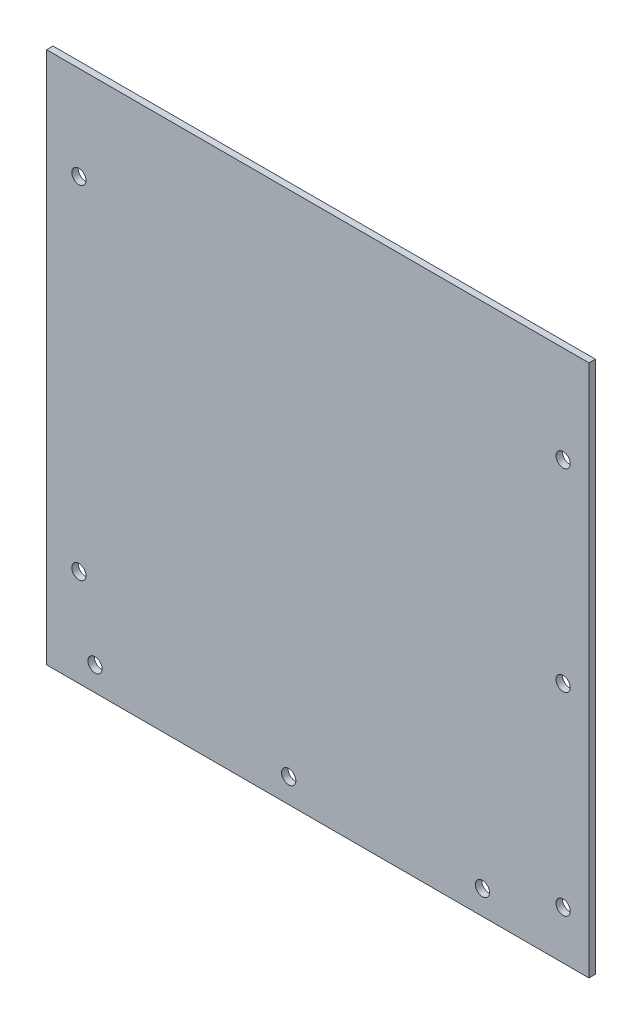
ISO-10303-21;
HEADER;
FILE_DESCRIPTION(('STEP AP214'),'2;1');
FILE_NAME('part.step','',(''),(''),'','','');
FILE_SCHEMA(('AUTOMOTIVE_DESIGN { 1 0 10303 214 1 1 1 1 }'));
ENDSEC;
DATA;
#1=APPLICATION_CONTEXT('core data for automotive mechanical design processes');
#2=APPLICATION_PROTOCOL_DEFINITION('international standard','automotive_design',2000,#1);
#3=PRODUCT_CONTEXT('',#1,'mechanical');
#4=PRODUCT('Part','Part','',(#3));
#5=PRODUCT_RELATED_PRODUCT_CATEGORY('part','',(#4));
#6=PRODUCT_DEFINITION_FORMATION('','',#4);
#7=PRODUCT_DEFINITION_CONTEXT('part definition',#1,'design');
#8=PRODUCT_DEFINITION('design','',#6,#7);
#9=PRODUCT_DEFINITION_SHAPE('','',#8);
#10=(LENGTH_UNIT() NAMED_UNIT(*) SI_UNIT(.MILLI.,.METRE.));
#11=(NAMED_UNIT(*) PLANE_ANGLE_UNIT() SI_UNIT($,.RADIAN.));
#12=(NAMED_UNIT(*) SI_UNIT($,.STERADIAN.) SOLID_ANGLE_UNIT());
#13=UNCERTAINTY_MEASURE_WITH_UNIT(LENGTH_MEASURE(1.E-05),#10,'distance_accuracy_value','');
#14=(GEOMETRIC_REPRESENTATION_CONTEXT(3) GLOBAL_UNCERTAINTY_ASSIGNED_CONTEXT((#13)) GLOBAL_UNIT_ASSIGNED_CONTEXT((#10,
#11,#12)) REPRESENTATION_CONTEXT('',''));
#15=CARTESIAN_POINT('',(0.,0.,0.));
#16=DIRECTION('',(0.,0.,1.));
#17=DIRECTION('',(1.,0.,0.));
#18=AXIS2_PLACEMENT_3D('',#15,#16,#17);
#19=CARTESIAN_POINT('',(84.,83.5,2.));
#20=DIRECTION('',(-1.,0.,0.));
#21=DIRECTION('',(0.,-1.,0.));
#22=AXIS2_PLACEMENT_3D('',#19,#20,#21);
#23=PLANE('',#22);
#24=DIRECTION('',(0.,1.,0.));
#25=VECTOR('',#24,1.);
#26=CARTESIAN_POINT('',(84.,83.5,0.));
#27=LINE('',#26,#25);
#28=CARTESIAN_POINT('',(84.,-83.5,0.));
#29=VERTEX_POINT('',#28);
#30=CARTESIAN_POINT('',(84.,81.5,0.));
#31=VERTEX_POINT('',#30);
#32=EDGE_CURVE('E88',#29,#31,#27,.T.);
#33=ORIENTED_EDGE('',*,*,#32,.T.);
#34=DIRECTION('',(0.,0.,-1.));
#35=VECTOR('',#34,1.);
#36=CARTESIAN_POINT('',(84.,81.5,2.));
#37=LINE('',#36,#35);
#38=CARTESIAN_POINT('',(84.,81.5,2.));
#39=VERTEX_POINT('',#38);
#40=EDGE_CURVE('E53',#39,#31,#37,.T.);
#41=ORIENTED_EDGE('',*,*,#40,.F.);
#42=DIRECTION('',(0.,1.,0.));
#43=VECTOR('',#42,1.);
#44=CARTESIAN_POINT('',(84.,83.5,2.));
#45=LINE('',#44,#43);
#46=CARTESIAN_POINT('',(84.,-83.5,2.));
#47=VERTEX_POINT('',#46);
#48=EDGE_CURVE('E83',#47,#39,#45,.T.);
#49=ORIENTED_EDGE('',*,*,#48,.F.);
#50=DIRECTION('',(0.,0.,-1.));
#51=VECTOR('',#50,1.);
#52=CARTESIAN_POINT('',(84.,-83.5,2.));
#53=LINE('',#52,#51);
#54=EDGE_CURVE('E46',#47,#29,#53,.T.);
#55=ORIENTED_EDGE('',*,*,#54,.T.);
#56=EDGE_LOOP('',(#33,#41,#49,#55));
#57=FACE_BOUND('',#56,.T.);
#58=ADVANCED_FACE('F38',(#57),#23,.F.);
#59=CARTESIAN_POINT('',(-84.,83.5,2.));
#60=DIRECTION('',(1.,0.,0.));
#61=DIRECTION('',(0.,1.,0.));
#62=AXIS2_PLACEMENT_3D('',#59,#60,#61);
#63=PLANE('',#62);
#64=DIRECTION('',(0.,-1.,0.));
#65=VECTOR('',#64,1.);
#66=CARTESIAN_POINT('',(-84.,83.5,2.));
#67=LINE('',#66,#65);
#68=CARTESIAN_POINT('',(-84.,81.5,2.));
#69=VERTEX_POINT('',#68);
#70=CARTESIAN_POINT('',(-84.,-83.5,2.));
#71=VERTEX_POINT('',#70);
#72=EDGE_CURVE('E104',#69,#71,#67,.T.);
#73=ORIENTED_EDGE('',*,*,#72,.F.);
#74=DIRECTION('',(0.,0.,1.));
#75=VECTOR('',#74,1.);
#76=CARTESIAN_POINT('',(-84.,81.5,2.));
#77=LINE('',#76,#75);
#78=CARTESIAN_POINT('',(-84.,81.5,0.));
#79=VERTEX_POINT('',#78);
#80=EDGE_CURVE('E135',#79,#69,#77,.T.);
#81=ORIENTED_EDGE('',*,*,#80,.F.);
#82=DIRECTION('',(0.,-1.,0.));
#83=VECTOR('',#82,1.);
#84=CARTESIAN_POINT('',(-84.,83.5,0.));
#85=LINE('',#84,#83);
#86=CARTESIAN_POINT('',(-84.,-83.5,0.));
#87=VERTEX_POINT('',#86);
#88=EDGE_CURVE('E84',#79,#87,#85,.T.);
#89=ORIENTED_EDGE('',*,*,#88,.T.);
#90=DIRECTION('',(0.,0.,-1.));
#91=VECTOR('',#90,1.);
#92=CARTESIAN_POINT('',(-84.,-83.5,2.));
#93=LINE('',#92,#91);
#94=EDGE_CURVE('E11',#71,#87,#93,.T.);
#95=ORIENTED_EDGE('',*,*,#94,.F.);
#96=EDGE_LOOP('',(#73,#81,#89,#95));
#97=FACE_BOUND('',#96,.T.);
#98=ADVANCED_FACE('F213',(#97),#63,.F.);
#99=CARTESIAN_POINT('',(-84.,-83.5,2.));
#100=DIRECTION('',(0.,1.,0.));
#101=DIRECTION('',(0.,0.,1.));
#102=AXIS2_PLACEMENT_3D('',#99,#100,#101);
#103=PLANE('',#102);
#104=DIRECTION('',(1.,0.,0.));
#105=VECTOR('',#104,1.);
#106=CARTESIAN_POINT('',(-84.,-83.5,0.));
#107=LINE('',#106,#105);
#108=EDGE_CURVE('E74',#87,#29,#107,.T.);
#109=ORIENTED_EDGE('',*,*,#108,.T.);
#110=ORIENTED_EDGE('',*,*,#54,.F.);
#111=DIRECTION('',(1.,0.,0.));
#112=VECTOR('',#111,1.);
#113=CARTESIAN_POINT('',(-84.,-83.5,2.));
#114=LINE('',#113,#112);
#115=EDGE_CURVE('E62',#71,#47,#114,.T.);
#116=ORIENTED_EDGE('',*,*,#115,.F.);
#117=ORIENTED_EDGE('',*,*,#94,.T.);
#118=EDGE_LOOP('',(#109,#110,#116,#117));
#119=FACE_BOUND('',#118,.T.);
#120=ADVANCED_FACE('F76',(#119),#103,.F.);
#121=CARTESIAN_POINT('',(0.,0.,2.));
#122=DIRECTION('',(0.,0.,1.));
#123=DIRECTION('',(1.,0.,0.));
#124=AXIS2_PLACEMENT_3D('',#121,#122,#123);
#125=PLANE('',#124);
#126=CARTESIAN_POINT('',(-74.,-53.5,2.));
#127=DIRECTION('',(0.,0.,1.));
#128=DIRECTION('',(1.,0.,0.));
#129=AXIS2_PLACEMENT_3D('',#126,#127,#128);
#130=CIRCLE('',#129,2.2);
#131=CARTESIAN_POINT('',(-71.8,-53.5,2.));
#132=VERTEX_POINT('',#131);
#133=EDGE_CURVE('E171',#132,#132,#130,.T.);
#134=ORIENTED_EDGE('',*,*,#133,.F.);
#135=EDGE_LOOP('',(#134));
#136=FACE_BOUND('',#135,.T.);
#137=CARTESIAN_POINT('',(-74.,52.5,2.));
#138=DIRECTION('',(0.,0.,1.));
#139=DIRECTION('',(1.,0.,0.));
#140=AXIS2_PLACEMENT_3D('',#137,#138,#139);
#141=CIRCLE('',#140,2.2);
#142=CARTESIAN_POINT('',(-71.8,52.5,2.));
#143=VERTEX_POINT('',#142);
#144=EDGE_CURVE('E153',#143,#143,#141,.T.);
#145=ORIENTED_EDGE('',*,*,#144,.F.);
#146=EDGE_LOOP('',(#145));
#147=FACE_BOUND('',#146,.T.);
#148=CARTESIAN_POINT('',(51.,-76.,2.));
#149=DIRECTION('',(0.,0.,1.));
#150=DIRECTION('',(1.,0.,0.));
#151=AXIS2_PLACEMENT_3D('',#148,#149,#150);
#152=CIRCLE('',#151,2.19999999999999);
#153=CARTESIAN_POINT('',(53.2,-76.,2.));
#154=VERTEX_POINT('',#153);
#155=EDGE_CURVE('E152',#154,#154,#152,.T.);
#156=ORIENTED_EDGE('',*,*,#155,.F.);
#157=EDGE_LOOP('',(#156));
#158=FACE_BOUND('',#157,.T.);
#159=CARTESIAN_POINT('',(-69.,-76.,2.));
#160=DIRECTION('',(0.,0.,1.));
#161=DIRECTION('',(1.,0.,0.));
#162=AXIS2_PLACEMENT_3D('',#159,#160,#161);
#163=CIRCLE('',#162,2.2);
#164=CARTESIAN_POINT('',(-66.8,-76.,2.));
#165=VERTEX_POINT('',#164);
#166=EDGE_CURVE('E144',#165,#165,#163,.T.);
#167=ORIENTED_EDGE('',*,*,#166,.F.);
#168=EDGE_LOOP('',(#167));
#169=FACE_BOUND('',#168,.T.);
#170=CARTESIAN_POINT('',(-9.00000000000001,-76.,2.));
#171=DIRECTION('',(0.,0.,1.));
#172=DIRECTION('',(1.,0.,0.));
#173=AXIS2_PLACEMENT_3D('',#170,#171,#172);
#174=CIRCLE('',#173,2.2);
#175=CARTESIAN_POINT('',(-6.80000000000001,-76.,2.));
#176=VERTEX_POINT('',#175);
#177=EDGE_CURVE('E140',#176,#176,#174,.T.);
#178=ORIENTED_EDGE('',*,*,#177,.F.);
#179=EDGE_LOOP('',(#178));
#180=FACE_BOUND('',#179,.T.);
#181=DIRECTION('',(1.,0.,0.));
#182=VECTOR('',#181,1.);
#183=CARTESIAN_POINT('',(-84.,81.5,2.));
#184=LINE('',#183,#182);
#185=EDGE_CURVE('E132',#69,#39,#184,.T.);
#186=ORIENTED_EDGE('',*,*,#185,.F.);
#187=ORIENTED_EDGE('',*,*,#72,.T.);
#188=ORIENTED_EDGE('',*,*,#115,.T.);
#189=ORIENTED_EDGE('',*,*,#48,.T.);
#190=EDGE_LOOP('',(#186,#187,#188,#189));
#191=FACE_BOUND('',#190,.T.);
#192=CARTESIAN_POINT('',(76.,51.5,2.));
#193=DIRECTION('',(0.,0.,1.));
#194=DIRECTION('',(1.,0.,0.));
#195=AXIS2_PLACEMENT_3D('',#192,#193,#194);
#196=CIRCLE('',#195,2.2);
#197=CARTESIAN_POINT('',(78.2,51.5,2.));
#198=VERTEX_POINT('',#197);
#199=EDGE_CURVE('E99',#198,#198,#196,.T.);
#200=ORIENTED_EDGE('',*,*,#199,.F.);
#201=EDGE_LOOP('',(#200));
#202=FACE_BOUND('',#201,.T.);
#203=CARTESIAN_POINT('',(76.,-8.50000000000001,2.));
#204=DIRECTION('',(0.,0.,1.));
#205=DIRECTION('',(1.,0.,0.));
#206=AXIS2_PLACEMENT_3D('',#203,#204,#205);
#207=CIRCLE('',#206,2.20000000000001);
#208=CARTESIAN_POINT('',(78.2,-8.50000000000001,2.));
#209=VERTEX_POINT('',#208);
#210=EDGE_CURVE('E117',#209,#209,#207,.T.);
#211=ORIENTED_EDGE('',*,*,#210,.F.);
#212=EDGE_LOOP('',(#211));
#213=FACE_BOUND('',#212,.T.);
#214=CARTESIAN_POINT('',(76.,-68.5,2.));
#215=DIRECTION('',(0.,0.,1.));
#216=DIRECTION('',(1.,0.,0.));
#217=AXIS2_PLACEMENT_3D('',#214,#215,#216);
#218=CIRCLE('',#217,2.2);
#219=CARTESIAN_POINT('',(78.2,-68.5,2.));
#220=VERTEX_POINT('',#219);
#221=EDGE_CURVE('E109',#220,#220,#218,.T.);
#222=ORIENTED_EDGE('',*,*,#221,.F.);
#223=EDGE_LOOP('',(#222));
#224=FACE_BOUND('',#223,.T.);
#225=ADVANCED_FACE('F185',(#136,#147,#158,#169,#180,#191,#202,#213,#224),#125,.T.);
#226=CARTESIAN_POINT('',(0.,0.,0.));
#227=DIRECTION('',(0.,0.,1.));
#228=DIRECTION('',(1.,0.,0.));
#229=AXIS2_PLACEMENT_3D('',#226,#227,#228);
#230=PLANE('',#229);
#231=CARTESIAN_POINT('',(-74.,-53.5,0.));
#232=DIRECTION('',(0.,0.,-1.));
#233=DIRECTION('',(-1.,0.,0.));
#234=AXIS2_PLACEMENT_3D('',#231,#232,#233);
#235=CIRCLE('',#234,2.2);
#236=CARTESIAN_POINT('',(-76.2,-53.5,0.));
#237=VERTEX_POINT('',#236);
#238=EDGE_CURVE('E175',#237,#237,#235,.T.);
#239=ORIENTED_EDGE('',*,*,#238,.F.);
#240=EDGE_LOOP('',(#239));
#241=FACE_BOUND('',#240,.T.);
#242=CARTESIAN_POINT('',(-74.,52.5,0.));
#243=DIRECTION('',(0.,0.,-1.));
#244=DIRECTION('',(-1.,0.,0.));
#245=AXIS2_PLACEMENT_3D('',#242,#243,#244);
#246=CIRCLE('',#245,2.2);
#247=CARTESIAN_POINT('',(-76.2,52.5,0.));
#248=VERTEX_POINT('',#247);
#249=EDGE_CURVE('E167',#248,#248,#246,.T.);
#250=ORIENTED_EDGE('',*,*,#249,.F.);
#251=EDGE_LOOP('',(#250));
#252=FACE_BOUND('',#251,.T.);
#253=CARTESIAN_POINT('',(51.,-76.,0.));
#254=DIRECTION('',(0.,0.,1.));
#255=DIRECTION('',(1.,0.,0.));
#256=AXIS2_PLACEMENT_3D('',#253,#254,#255);
#257=CIRCLE('',#256,2.19999999999999);
#258=CARTESIAN_POINT('',(53.2,-76.,0.));
#259=VERTEX_POINT('',#258);
#260=EDGE_CURVE('E148',#259,#259,#257,.T.);
#261=ORIENTED_EDGE('',*,*,#260,.T.);
#262=EDGE_LOOP('',(#261));
#263=FACE_BOUND('',#262,.T.);
#264=CARTESIAN_POINT('',(-69.,-76.,0.));
#265=DIRECTION('',(0.,0.,1.));
#266=DIRECTION('',(1.,0.,0.));
#267=AXIS2_PLACEMENT_3D('',#264,#265,#266);
#268=CIRCLE('',#267,2.2);
#269=CARTESIAN_POINT('',(-66.8,-76.,0.));
#270=VERTEX_POINT('',#269);
#271=EDGE_CURVE('E157',#270,#270,#268,.T.);
#272=ORIENTED_EDGE('',*,*,#271,.T.);
#273=EDGE_LOOP('',(#272));
#274=FACE_BOUND('',#273,.T.);
#275=CARTESIAN_POINT('',(-9.00000000000001,-76.,0.));
#276=DIRECTION('',(0.,0.,1.));
#277=DIRECTION('',(1.,0.,0.));
#278=AXIS2_PLACEMENT_3D('',#275,#276,#277);
#279=CIRCLE('',#278,2.2);
#280=CARTESIAN_POINT('',(-6.80000000000001,-76.,0.));
#281=VERTEX_POINT('',#280);
#282=EDGE_CURVE('E139',#281,#281,#279,.T.);
#283=ORIENTED_EDGE('',*,*,#282,.T.);
#284=EDGE_LOOP('',(#283));
#285=FACE_BOUND('',#284,.T.);
#286=CARTESIAN_POINT('',(76.,51.5,0.));
#287=DIRECTION('',(0.,0.,1.));
#288=DIRECTION('',(1.,0.,0.));
#289=AXIS2_PLACEMENT_3D('',#286,#287,#288);
#290=CIRCLE('',#289,2.2);
#291=CARTESIAN_POINT('',(78.2,51.5,0.));
#292=VERTEX_POINT('',#291);
#293=EDGE_CURVE('E93',#292,#292,#290,.T.);
#294=ORIENTED_EDGE('',*,*,#293,.T.);
#295=EDGE_LOOP('',(#294));
#296=FACE_BOUND('',#295,.T.);
#297=CARTESIAN_POINT('',(76.,-8.50000000000001,0.));
#298=DIRECTION('',(0.,0.,1.));
#299=DIRECTION('',(1.,0.,0.));
#300=AXIS2_PLACEMENT_3D('',#297,#298,#299);
#301=CIRCLE('',#300,2.20000000000001);
#302=CARTESIAN_POINT('',(78.2,-8.50000000000001,0.));
#303=VERTEX_POINT('',#302);
#304=EDGE_CURVE('E121',#303,#303,#301,.T.);
#305=ORIENTED_EDGE('',*,*,#304,.T.);
#306=EDGE_LOOP('',(#305));
#307=FACE_BOUND('',#306,.T.);
#308=CARTESIAN_POINT('',(76.,-68.5,0.));
#309=DIRECTION('',(0.,0.,1.));
#310=DIRECTION('',(1.,0.,0.));
#311=AXIS2_PLACEMENT_3D('',#308,#309,#310);
#312=CIRCLE('',#311,2.2);
#313=CARTESIAN_POINT('',(78.2,-68.5,0.));
#314=VERTEX_POINT('',#313);
#315=EDGE_CURVE('E113',#314,#314,#312,.T.);
#316=ORIENTED_EDGE('',*,*,#315,.T.);
#317=EDGE_LOOP('',(#316));
#318=FACE_BOUND('',#317,.T.);
#319=ORIENTED_EDGE('',*,*,#88,.F.);
#320=DIRECTION('',(-1.,0.,0.));
#321=VECTOR('',#320,1.);
#322=CARTESIAN_POINT('',(-84.,81.5,0.));
#323=LINE('',#322,#321);
#324=EDGE_CURVE('E91',#31,#79,#323,.T.);
#325=ORIENTED_EDGE('',*,*,#324,.F.);
#326=ORIENTED_EDGE('',*,*,#32,.F.);
#327=ORIENTED_EDGE('',*,*,#108,.F.);
#328=EDGE_LOOP('',(#319,#325,#326,#327));
#329=FACE_BOUND('',#328,.T.);
#330=ADVANCED_FACE('F90',(#241,#252,#263,#274,#285,#296,#307,#318,#329),#230,.F.);
#331=CARTESIAN_POINT('',(76.,-68.5,0.));
#332=DIRECTION('',(0.,0.,1.));
#333=DIRECTION('',(1.,0.,0.));
#334=AXIS2_PLACEMENT_3D('',#331,#332,#333);
#335=CYLINDRICAL_SURFACE('',#334,2.2);
#336=ORIENTED_EDGE('',*,*,#315,.F.);
#337=EDGE_LOOP('',(#336));
#338=FACE_BOUND('',#337,.T.);
#339=ORIENTED_EDGE('',*,*,#221,.T.);
#340=EDGE_LOOP('',(#339));
#341=FACE_BOUND('',#340,.T.);
#342=ADVANCED_FACE('F184',(#338,#341),#335,.F.);
#343=CARTESIAN_POINT('',(76.,-8.50000000000001,0.));
#344=DIRECTION('',(0.,0.,1.));
#345=DIRECTION('',(1.,0.,0.));
#346=AXIS2_PLACEMENT_3D('',#343,#344,#345);
#347=CYLINDRICAL_SURFACE('',#346,2.20000000000001);
#348=ORIENTED_EDGE('',*,*,#304,.F.);
#349=EDGE_LOOP('',(#348));
#350=FACE_BOUND('',#349,.T.);
#351=ORIENTED_EDGE('',*,*,#210,.T.);
#352=EDGE_LOOP('',(#351));
#353=FACE_BOUND('',#352,.T.);
#354=ADVANCED_FACE('F203',(#350,#353),#347,.F.);
#355=CARTESIAN_POINT('',(76.,51.5,0.));
#356=DIRECTION('',(0.,0.,1.));
#357=DIRECTION('',(1.,0.,0.));
#358=AXIS2_PLACEMENT_3D('',#355,#356,#357);
#359=CYLINDRICAL_SURFACE('',#358,2.2);
#360=ORIENTED_EDGE('',*,*,#293,.F.);
#361=EDGE_LOOP('',(#360));
#362=FACE_BOUND('',#361,.T.);
#363=ORIENTED_EDGE('',*,*,#199,.T.);
#364=EDGE_LOOP('',(#363));
#365=FACE_BOUND('',#364,.T.);
#366=ADVANCED_FACE('F235',(#362,#365),#359,.F.);
#367=CARTESIAN_POINT('',(0.,81.5,0.));
#368=DIRECTION('',(0.,-1.,0.));
#369=DIRECTION('',(0.,0.,-1.));
#370=AXIS2_PLACEMENT_3D('',#367,#368,#369);
#371=PLANE('',#370);
#372=ORIENTED_EDGE('',*,*,#80,.T.);
#373=ORIENTED_EDGE('',*,*,#185,.T.);
#374=ORIENTED_EDGE('',*,*,#40,.T.);
#375=ORIENTED_EDGE('',*,*,#324,.T.);
#376=EDGE_LOOP('',(#372,#373,#374,#375));
#377=FACE_BOUND('',#376,.T.);
#378=ADVANCED_FACE('F231',(#377),#371,.F.);
#379=CARTESIAN_POINT('',(-9.00000000000001,-76.,0.));
#380=DIRECTION('',(0.,0.,1.));
#381=DIRECTION('',(1.,0.,0.));
#382=AXIS2_PLACEMENT_3D('',#379,#380,#381);
#383=CYLINDRICAL_SURFACE('',#382,2.2);
#384=ORIENTED_EDGE('',*,*,#282,.F.);
#385=EDGE_LOOP('',(#384));
#386=FACE_BOUND('',#385,.T.);
#387=ORIENTED_EDGE('',*,*,#177,.T.);
#388=EDGE_LOOP('',(#387));
#389=FACE_BOUND('',#388,.T.);
#390=ADVANCED_FACE('F234',(#386,#389),#383,.F.);
#391=CARTESIAN_POINT('',(-69.,-76.,0.));
#392=DIRECTION('',(0.,0.,1.));
#393=DIRECTION('',(1.,0.,0.));
#394=AXIS2_PLACEMENT_3D('',#391,#392,#393);
#395=CYLINDRICAL_SURFACE('',#394,2.2);
#396=ORIENTED_EDGE('',*,*,#271,.F.);
#397=EDGE_LOOP('',(#396));
#398=FACE_BOUND('',#397,.T.);
#399=ORIENTED_EDGE('',*,*,#166,.T.);
#400=EDGE_LOOP('',(#399));
#401=FACE_BOUND('',#400,.T.);
#402=ADVANCED_FACE('F241',(#398,#401),#395,.F.);
#403=CARTESIAN_POINT('',(51.,-76.,0.));
#404=DIRECTION('',(0.,0.,1.));
#405=DIRECTION('',(1.,0.,0.));
#406=AXIS2_PLACEMENT_3D('',#403,#404,#405);
#407=CYLINDRICAL_SURFACE('',#406,2.19999999999999);
#408=ORIENTED_EDGE('',*,*,#260,.F.);
#409=EDGE_LOOP('',(#408));
#410=FACE_BOUND('',#409,.T.);
#411=ORIENTED_EDGE('',*,*,#155,.T.);
#412=EDGE_LOOP('',(#411));
#413=FACE_BOUND('',#412,.T.);
#414=ADVANCED_FACE('F289',(#410,#413),#407,.F.);
#415=CARTESIAN_POINT('',(-74.,52.5,10.));
#416=DIRECTION('',(0.,0.,-1.));
#417=DIRECTION('',(-1.,0.,0.));
#418=AXIS2_PLACEMENT_3D('',#415,#416,#417);
#419=CYLINDRICAL_SURFACE('',#418,2.2);
#420=ORIENTED_EDGE('',*,*,#144,.T.);
#421=EDGE_LOOP('',(#420));
#422=FACE_BOUND('',#421,.T.);
#423=ORIENTED_EDGE('',*,*,#249,.T.);
#424=EDGE_LOOP('',(#423));
#425=FACE_BOUND('',#424,.T.);
#426=ADVANCED_FACE('F299',(#422,#425),#419,.F.);
#427=CARTESIAN_POINT('',(-74.,-53.5,10.));
#428=DIRECTION('',(0.,0.,-1.));
#429=DIRECTION('',(-1.,0.,0.));
#430=AXIS2_PLACEMENT_3D('',#427,#428,#429);
#431=CYLINDRICAL_SURFACE('',#430,2.2);
#432=ORIENTED_EDGE('',*,*,#133,.T.);
#433=EDGE_LOOP('',(#432));
#434=FACE_BOUND('',#433,.T.);
#435=ORIENTED_EDGE('',*,*,#238,.T.);
#436=EDGE_LOOP('',(#435));
#437=FACE_BOUND('',#436,.T.);
#438=ADVANCED_FACE('F180',(#434,#437),#431,.F.);
#439=CLOSED_SHELL('',(#58,#98,#120,#225,#330,#342,#354,#366,#378,#390,#402,#414,#426,#438));
#440=MANIFOLD_SOLID_BREP('B2',#439);
#441=ADVANCED_BREP_SHAPE_REPRESENTATION('',(#18,#440),#14);
#442=SHAPE_DEFINITION_REPRESENTATION(#9,#441);
ENDSEC;
END-ISO-10303-21;
